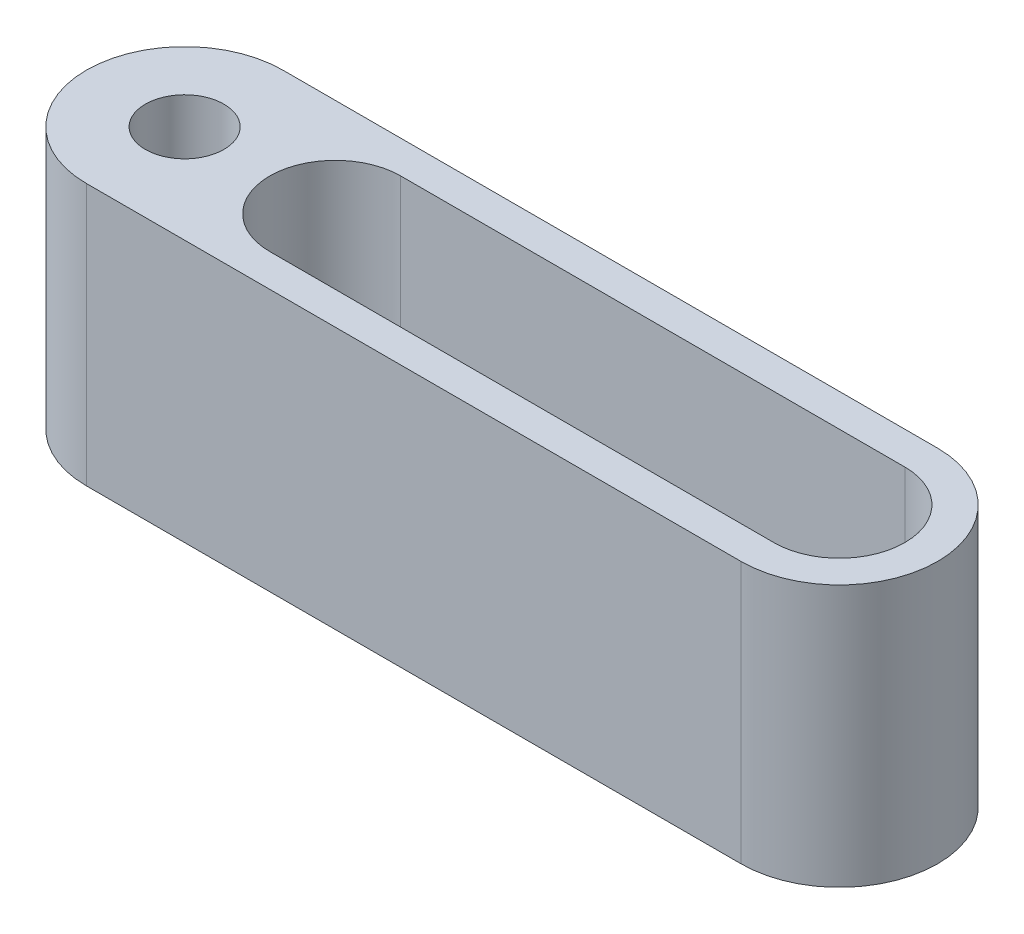
ISO-10303-21;
HEADER;
FILE_DESCRIPTION(('STEP AP214'),'2;1');
FILE_NAME('part.step','',(''),(''),'','','');
FILE_SCHEMA(('AUTOMOTIVE_DESIGN { 1 0 10303 214 1 1 1 1 }'));
ENDSEC;
DATA;
#1=APPLICATION_CONTEXT('core data for automotive mechanical design processes');
#2=APPLICATION_PROTOCOL_DEFINITION('international standard','automotive_design',2000,#1);
#3=PRODUCT_CONTEXT('',#1,'mechanical');
#4=PRODUCT('Part','Part','',(#3));
#5=PRODUCT_RELATED_PRODUCT_CATEGORY('part','',(#4));
#6=PRODUCT_DEFINITION_FORMATION('','',#4);
#7=PRODUCT_DEFINITION_CONTEXT('part definition',#1,'design');
#8=PRODUCT_DEFINITION('design','',#6,#7);
#9=PRODUCT_DEFINITION_SHAPE('','',#8);
#10=(LENGTH_UNIT() NAMED_UNIT(*) SI_UNIT(.MILLI.,.METRE.));
#11=(NAMED_UNIT(*) PLANE_ANGLE_UNIT() SI_UNIT($,.RADIAN.));
#12=(NAMED_UNIT(*) SI_UNIT($,.STERADIAN.) SOLID_ANGLE_UNIT());
#13=UNCERTAINTY_MEASURE_WITH_UNIT(LENGTH_MEASURE(1.E-05),#10,'distance_accuracy_value','');
#14=(GEOMETRIC_REPRESENTATION_CONTEXT(3) GLOBAL_UNCERTAINTY_ASSIGNED_CONTEXT((#13)) GLOBAL_UNIT_ASSIGNED_CONTEXT((#10,
#11,#12)) REPRESENTATION_CONTEXT('',''));
#15=CARTESIAN_POINT('',(0.,0.,0.));
#16=DIRECTION('',(0.,0.,1.));
#17=DIRECTION('',(1.,0.,0.));
#18=AXIS2_PLACEMENT_3D('',#15,#16,#17);
#19=CARTESIAN_POINT('',(0.,40.,0.));
#20=DIRECTION('',(0.,1.,0.));
#21=DIRECTION('',(0.,0.,1.));
#22=AXIS2_PLACEMENT_3D('',#19,#20,#21);
#23=PLANE('',#22);
#24=CARTESIAN_POINT('',(0.,40.,0.));
#25=DIRECTION('',(0.,1.,0.));
#26=DIRECTION('',(0.,0.,1.));
#27=AXIS2_PLACEMENT_3D('',#24,#25,#26);
#28=CIRCLE('',#27,15.);
#29=CARTESIAN_POINT('',(0.,40.,-15.));
#30=VERTEX_POINT('',#29);
#31=CARTESIAN_POINT('',(0.,40.,15.));
#32=VERTEX_POINT('',#31);
#33=EDGE_CURVE('E161',#30,#32,#28,.T.);
#34=ORIENTED_EDGE('',*,*,#33,.T.);
#35=DIRECTION('',(1.,0.,0.));
#36=VECTOR('',#35,1.);
#37=CARTESIAN_POINT('',(0.,40.,15.));
#38=LINE('',#37,#36);
#39=CARTESIAN_POINT('',(100.,40.,15.));
#40=VERTEX_POINT('',#39);
#41=EDGE_CURVE('E165',#32,#40,#38,.T.);
#42=ORIENTED_EDGE('',*,*,#41,.T.);
#43=CARTESIAN_POINT('',(100.,40.,0.));
#44=DIRECTION('',(0.,1.,0.));
#45=DIRECTION('',(0.,0.,-1.));
#46=AXIS2_PLACEMENT_3D('',#43,#44,#45);
#47=CIRCLE('',#46,15.);
#48=CARTESIAN_POINT('',(100.,40.,-15.));
#49=VERTEX_POINT('',#48);
#50=EDGE_CURVE('E169',#40,#49,#47,.T.);
#51=ORIENTED_EDGE('',*,*,#50,.T.);
#52=DIRECTION('',(-1.,0.,0.));
#53=VECTOR('',#52,1.);
#54=CARTESIAN_POINT('',(0.,40.,-15.));
#55=LINE('',#54,#53);
#56=EDGE_CURVE('E172',#49,#30,#55,.T.);
#57=ORIENTED_EDGE('',*,*,#56,.T.);
#58=EDGE_LOOP('',(#34,#42,#51,#57));
#59=FACE_BOUND('',#58,.T.);
#60=CARTESIAN_POINT('',(0.,40.,0.));
#61=DIRECTION('',(0.,1.,0.));
#62=DIRECTION('',(0.,0.,1.));
#63=AXIS2_PLACEMENT_3D('',#60,#61,#62);
#64=CIRCLE('',#63,6.);
#65=CARTESIAN_POINT('',(0.,40.,6.));
#66=VERTEX_POINT('',#65);
#67=EDGE_CURVE('E156',#66,#66,#64,.T.);
#68=ORIENTED_EDGE('',*,*,#67,.F.);
#69=EDGE_LOOP('',(#68));
#70=FACE_BOUND('',#69,.T.);
#71=DIRECTION('',(1.,0.,0.));
#72=VECTOR('',#71,1.);
#73=CARTESIAN_POINT('',(23.,40.,10.));
#74=LINE('',#73,#72);
#75=CARTESIAN_POINT('',(23.,40.,10.));
#76=VERTEX_POINT('',#75);
#77=CARTESIAN_POINT('',(100.,40.,9.99999999999999));
#78=VERTEX_POINT('',#77);
#79=EDGE_CURVE('E136',#76,#78,#74,.T.);
#80=ORIENTED_EDGE('',*,*,#79,.F.);
#81=CARTESIAN_POINT('',(23.,40.,0.));
#82=DIRECTION('',(0.,1.,0.));
#83=DIRECTION('',(0.,0.,1.));
#84=AXIS2_PLACEMENT_3D('',#81,#82,#83);
#85=CIRCLE('',#84,10.);
#86=CARTESIAN_POINT('',(23.,40.,-10.));
#87=VERTEX_POINT('',#86);
#88=EDGE_CURVE('E132',#87,#76,#85,.T.);
#89=ORIENTED_EDGE('',*,*,#88,.F.);
#90=DIRECTION('',(-1.,0.,0.));
#91=VECTOR('',#90,1.);
#92=CARTESIAN_POINT('',(23.,40.,-10.));
#93=LINE('',#92,#91);
#94=CARTESIAN_POINT('',(100.,40.,-9.99999999999999));
#95=VERTEX_POINT('',#94);
#96=EDGE_CURVE('E117',#95,#87,#93,.T.);
#97=ORIENTED_EDGE('',*,*,#96,.F.);
#98=CARTESIAN_POINT('',(100.,40.,0.));
#99=DIRECTION('',(0.,1.,0.));
#100=DIRECTION('',(0.,0.,1.));
#101=AXIS2_PLACEMENT_3D('',#98,#99,#100);
#102=CIRCLE('',#101,9.99999999999999);
#103=EDGE_CURVE('E143',#78,#95,#102,.T.);
#104=ORIENTED_EDGE('',*,*,#103,.F.);
#105=EDGE_LOOP('',(#80,#89,#97,#104));
#106=FACE_BOUND('',#105,.T.);
#107=ADVANCED_FACE('F43',(#59,#70,#106),#23,.T.);
#108=CARTESIAN_POINT('',(0.,0.,0.));
#109=DIRECTION('',(0.,1.,0.));
#110=DIRECTION('',(0.,0.,1.));
#111=AXIS2_PLACEMENT_3D('',#108,#109,#110);
#112=PLANE('',#111);
#113=CARTESIAN_POINT('',(0.,0.,0.));
#114=DIRECTION('',(0.,1.,0.));
#115=DIRECTION('',(0.,0.,1.));
#116=AXIS2_PLACEMENT_3D('',#113,#114,#115);
#117=CIRCLE('',#116,15.);
#118=CARTESIAN_POINT('',(0.,0.,-15.));
#119=VERTEX_POINT('',#118);
#120=CARTESIAN_POINT('',(0.,0.,15.));
#121=VERTEX_POINT('',#120);
#122=EDGE_CURVE('E160',#119,#121,#117,.T.);
#123=ORIENTED_EDGE('',*,*,#122,.F.);
#124=DIRECTION('',(-1.,0.,0.));
#125=VECTOR('',#124,1.);
#126=CARTESIAN_POINT('',(0.,0.,-15.));
#127=LINE('',#126,#125);
#128=CARTESIAN_POINT('',(100.,0.,-15.));
#129=VERTEX_POINT('',#128);
#130=EDGE_CURVE('E166',#129,#119,#127,.T.);
#131=ORIENTED_EDGE('',*,*,#130,.F.);
#132=CARTESIAN_POINT('',(100.,0.,0.));
#133=DIRECTION('',(0.,1.,0.));
#134=DIRECTION('',(0.,0.,-1.));
#135=AXIS2_PLACEMENT_3D('',#132,#133,#134);
#136=CIRCLE('',#135,15.);
#137=CARTESIAN_POINT('',(100.,0.,15.));
#138=VERTEX_POINT('',#137);
#139=EDGE_CURVE('E182',#138,#129,#136,.T.);
#140=ORIENTED_EDGE('',*,*,#139,.F.);
#141=DIRECTION('',(1.,0.,0.));
#142=VECTOR('',#141,1.);
#143=CARTESIAN_POINT('',(0.,0.,15.));
#144=LINE('',#143,#142);
#145=EDGE_CURVE('E179',#121,#138,#144,.T.);
#146=ORIENTED_EDGE('',*,*,#145,.F.);
#147=EDGE_LOOP('',(#123,#131,#140,#146));
#148=FACE_BOUND('',#147,.T.);
#149=ADVANCED_FACE('F209',(#148),#112,.F.);
#150=CARTESIAN_POINT('',(0.,40.,0.));
#151=DIRECTION('',(0.,-1.,0.));
#152=DIRECTION('',(0.,0.,-1.));
#153=AXIS2_PLACEMENT_3D('',#150,#151,#152);
#154=CYLINDRICAL_SURFACE('',#153,15.);
#155=ORIENTED_EDGE('',*,*,#122,.T.);
#156=DIRECTION('',(0.,-1.,0.));
#157=VECTOR('',#156,1.);
#158=CARTESIAN_POINT('',(0.,40.,15.));
#159=LINE('',#158,#157);
#160=EDGE_CURVE('E52',#32,#121,#159,.T.);
#161=ORIENTED_EDGE('',*,*,#160,.F.);
#162=ORIENTED_EDGE('',*,*,#33,.F.);
#163=DIRECTION('',(0.,-1.,0.));
#164=VECTOR('',#163,1.);
#165=CARTESIAN_POINT('',(0.,40.,-15.));
#166=LINE('',#165,#164);
#167=EDGE_CURVE('E175',#30,#119,#166,.T.);
#168=ORIENTED_EDGE('',*,*,#167,.T.);
#169=EDGE_LOOP('',(#155,#161,#162,#168));
#170=FACE_BOUND('',#169,.T.);
#171=ADVANCED_FACE('F45',(#170),#154,.T.);
#172=CARTESIAN_POINT('',(0.,40.,15.));
#173=DIRECTION('',(0.,0.,-1.));
#174=DIRECTION('',(-1.,0.,0.));
#175=AXIS2_PLACEMENT_3D('',#172,#173,#174);
#176=PLANE('',#175);
#177=ORIENTED_EDGE('',*,*,#145,.T.);
#178=DIRECTION('',(0.,-1.,0.));
#179=VECTOR('',#178,1.);
#180=CARTESIAN_POINT('',(100.,40.,15.));
#181=LINE('',#180,#179);
#182=EDGE_CURVE('E194',#40,#138,#181,.T.);
#183=ORIENTED_EDGE('',*,*,#182,.F.);
#184=ORIENTED_EDGE('',*,*,#41,.F.);
#185=ORIENTED_EDGE('',*,*,#160,.T.);
#186=EDGE_LOOP('',(#177,#183,#184,#185));
#187=FACE_BOUND('',#186,.T.);
#188=ADVANCED_FACE('F201',(#187),#176,.F.);
#189=CARTESIAN_POINT('',(100.,40.,0.));
#190=DIRECTION('',(0.,-1.,0.));
#191=DIRECTION('',(0.,0.,-1.));
#192=AXIS2_PLACEMENT_3D('',#189,#190,#191);
#193=CYLINDRICAL_SURFACE('',#192,15.);
#194=ORIENTED_EDGE('',*,*,#139,.T.);
#195=DIRECTION('',(0.,-1.,0.));
#196=VECTOR('',#195,1.);
#197=CARTESIAN_POINT('',(100.,40.,-15.));
#198=LINE('',#197,#196);
#199=EDGE_CURVE('E190',#49,#129,#198,.T.);
#200=ORIENTED_EDGE('',*,*,#199,.F.);
#201=ORIENTED_EDGE('',*,*,#50,.F.);
#202=ORIENTED_EDGE('',*,*,#182,.T.);
#203=EDGE_LOOP('',(#194,#200,#201,#202));
#204=FACE_BOUND('',#203,.T.);
#205=ADVANCED_FACE('F213',(#204),#193,.T.);
#206=CARTESIAN_POINT('',(0.,40.,-15.));
#207=DIRECTION('',(0.,0.,1.));
#208=DIRECTION('',(1.,0.,0.));
#209=AXIS2_PLACEMENT_3D('',#206,#207,#208);
#210=PLANE('',#209);
#211=ORIENTED_EDGE('',*,*,#130,.T.);
#212=ORIENTED_EDGE('',*,*,#167,.F.);
#213=ORIENTED_EDGE('',*,*,#56,.F.);
#214=ORIENTED_EDGE('',*,*,#199,.T.);
#215=EDGE_LOOP('',(#211,#212,#213,#214));
#216=FACE_BOUND('',#215,.T.);
#217=ADVANCED_FACE('F217',(#216),#210,.F.);
#218=CARTESIAN_POINT('',(0.,40.,0.));
#219=DIRECTION('',(0.,-1.,0.));
#220=DIRECTION('',(0.,0.,-1.));
#221=AXIS2_PLACEMENT_3D('',#218,#219,#220);
#222=CYLINDRICAL_SURFACE('',#221,6.);
#223=CARTESIAN_POINT('',(0.,4.,0.));
#224=DIRECTION('',(0.,1.,0.));
#225=DIRECTION('',(0.,0.,1.));
#226=AXIS2_PLACEMENT_3D('',#223,#224,#225);
#227=CIRCLE('',#226,6.);
#228=CARTESIAN_POINT('',(0.,4.,6.));
#229=VERTEX_POINT('',#228);
#230=EDGE_CURVE('E11',#229,#229,#227,.T.);
#231=ORIENTED_EDGE('',*,*,#230,.F.);
#232=EDGE_LOOP('',(#231));
#233=FACE_BOUND('',#232,.T.);
#234=ORIENTED_EDGE('',*,*,#67,.T.);
#235=EDGE_LOOP('',(#234));
#236=FACE_BOUND('',#235,.T.);
#237=ADVANCED_FACE('F240',(#233,#236),#222,.F.);
#238=CARTESIAN_POINT('',(23.,40.,0.));
#239=DIRECTION('',(0.,-1.,0.));
#240=DIRECTION('',(0.,0.,-1.));
#241=AXIS2_PLACEMENT_3D('',#238,#239,#240);
#242=CYLINDRICAL_SURFACE('',#241,10.);
#243=CARTESIAN_POINT('',(23.,4.,0.));
#244=DIRECTION('',(0.,1.,0.));
#245=DIRECTION('',(0.,0.,1.));
#246=AXIS2_PLACEMENT_3D('',#243,#244,#245);
#247=CIRCLE('',#246,10.);
#248=CARTESIAN_POINT('',(23.,4.,-10.));
#249=VERTEX_POINT('',#248);
#250=CARTESIAN_POINT('',(23.,4.,10.));
#251=VERTEX_POINT('',#250);
#252=EDGE_CURVE('E124',#249,#251,#247,.T.);
#253=ORIENTED_EDGE('',*,*,#252,.F.);
#254=DIRECTION('',(0.,-1.,0.));
#255=VECTOR('',#254,1.);
#256=CARTESIAN_POINT('',(23.,40.,-10.));
#257=LINE('',#256,#255);
#258=EDGE_CURVE('E111',#87,#249,#257,.T.);
#259=ORIENTED_EDGE('',*,*,#258,.F.);
#260=ORIENTED_EDGE('',*,*,#88,.T.);
#261=DIRECTION('',(0.,-1.,0.));
#262=VECTOR('',#261,1.);
#263=CARTESIAN_POINT('',(23.,40.,10.));
#264=LINE('',#263,#262);
#265=EDGE_CURVE('E126',#76,#251,#264,.T.);
#266=ORIENTED_EDGE('',*,*,#265,.T.);
#267=EDGE_LOOP('',(#253,#259,#260,#266));
#268=FACE_BOUND('',#267,.T.);
#269=ADVANCED_FACE('F125',(#268),#242,.F.);
#270=CARTESIAN_POINT('',(23.,40.,10.));
#271=DIRECTION('',(0.,0.,-1.));
#272=DIRECTION('',(-1.,0.,0.));
#273=AXIS2_PLACEMENT_3D('',#270,#271,#272);
#274=PLANE('',#273);
#275=DIRECTION('',(1.,0.,0.));
#276=VECTOR('',#275,1.);
#277=CARTESIAN_POINT('',(0.,4.,10.));
#278=LINE('',#277,#276);
#279=CARTESIAN_POINT('',(100.,4.,9.99999999999999));
#280=VERTEX_POINT('',#279);
#281=EDGE_CURVE('E59',#251,#280,#278,.T.);
#282=ORIENTED_EDGE('',*,*,#281,.F.);
#283=ORIENTED_EDGE('',*,*,#265,.F.);
#284=ORIENTED_EDGE('',*,*,#79,.T.);
#285=DIRECTION('',(0.,-1.,0.));
#286=VECTOR('',#285,1.);
#287=CARTESIAN_POINT('',(100.,40.,9.99999999999999));
#288=LINE('',#287,#286);
#289=EDGE_CURVE('E151',#78,#280,#288,.T.);
#290=ORIENTED_EDGE('',*,*,#289,.T.);
#291=EDGE_LOOP('',(#282,#283,#284,#290));
#292=FACE_BOUND('',#291,.T.);
#293=ADVANCED_FACE('F226',(#292),#274,.T.);
#294=CARTESIAN_POINT('',(100.,40.,0.));
#295=DIRECTION('',(0.,-1.,0.));
#296=DIRECTION('',(0.,0.,-1.));
#297=AXIS2_PLACEMENT_3D('',#294,#295,#296);
#298=CYLINDRICAL_SURFACE('',#297,9.99999999999999);
#299=CARTESIAN_POINT('',(100.,4.,0.));
#300=DIRECTION('',(0.,1.,0.));
#301=DIRECTION('',(0.,0.,1.));
#302=AXIS2_PLACEMENT_3D('',#299,#300,#301);
#303=CIRCLE('',#302,9.99999999999999);
#304=CARTESIAN_POINT('',(100.,4.,-9.99999999999999));
#305=VERTEX_POINT('',#304);
#306=EDGE_CURVE('E67',#280,#305,#303,.T.);
#307=ORIENTED_EDGE('',*,*,#306,.F.);
#308=ORIENTED_EDGE('',*,*,#289,.F.);
#309=ORIENTED_EDGE('',*,*,#103,.T.);
#310=DIRECTION('',(0.,-1.,0.));
#311=VECTOR('',#310,1.);
#312=CARTESIAN_POINT('',(100.,40.,-9.99999999999999));
#313=LINE('',#312,#311);
#314=EDGE_CURVE('E121',#95,#305,#313,.T.);
#315=ORIENTED_EDGE('',*,*,#314,.T.);
#316=EDGE_LOOP('',(#307,#308,#309,#315));
#317=FACE_BOUND('',#316,.T.);
#318=ADVANCED_FACE('F227',(#317),#298,.F.);
#319=CARTESIAN_POINT('',(23.,40.,-10.));
#320=DIRECTION('',(0.,0.,1.));
#321=DIRECTION('',(1.,0.,0.));
#322=AXIS2_PLACEMENT_3D('',#319,#320,#321);
#323=PLANE('',#322);
#324=DIRECTION('',(1.,0.,0.));
#325=VECTOR('',#324,1.);
#326=CARTESIAN_POINT('',(0.,4.,-10.));
#327=LINE('',#326,#325);
#328=EDGE_CURVE('E115',#249,#305,#327,.T.);
#329=ORIENTED_EDGE('',*,*,#328,.T.);
#330=ORIENTED_EDGE('',*,*,#314,.F.);
#331=ORIENTED_EDGE('',*,*,#96,.T.);
#332=ORIENTED_EDGE('',*,*,#258,.T.);
#333=EDGE_LOOP('',(#329,#330,#331,#332));
#334=FACE_BOUND('',#333,.T.);
#335=ADVANCED_FACE('F113',(#334),#323,.T.);
#336=CARTESIAN_POINT('',(0.,4.,0.));
#337=DIRECTION('',(0.,1.,0.));
#338=DIRECTION('',(0.,0.,1.));
#339=AXIS2_PLACEMENT_3D('',#336,#337,#338);
#340=PLANE('',#339);
#341=ORIENTED_EDGE('',*,*,#252,.T.);
#342=ORIENTED_EDGE('',*,*,#281,.T.);
#343=ORIENTED_EDGE('',*,*,#306,.T.);
#344=ORIENTED_EDGE('',*,*,#328,.F.);
#345=EDGE_LOOP('',(#341,#342,#343,#344));
#346=FACE_BOUND('',#345,.T.);
#347=ADVANCED_FACE('F130',(#346),#340,.T.);
#348=CARTESIAN_POINT('',(0.,4.,0.));
#349=DIRECTION('',(0.,1.,0.));
#350=DIRECTION('',(0.,0.,1.));
#351=AXIS2_PLACEMENT_3D('',#348,#349,#350);
#352=PLANE('',#351);
#353=ORIENTED_EDGE('',*,*,#230,.T.);
#354=EDGE_LOOP('',(#353));
#355=FACE_BOUND('',#354,.T.);
#356=ADVANCED_FACE('F343',(#355),#352,.T.);
#357=CLOSED_SHELL('',(#107,#149,#171,#188,#205,#217,#237,#269,#293,#318,#335,#347,#356));
#358=MANIFOLD_SOLID_BREP('B2',#357);
#359=ADVANCED_BREP_SHAPE_REPRESENTATION('',(#18,#358),#14);
#360=SHAPE_DEFINITION_REPRESENTATION(#9,#359);
ENDSEC;
END-ISO-10303-21;
